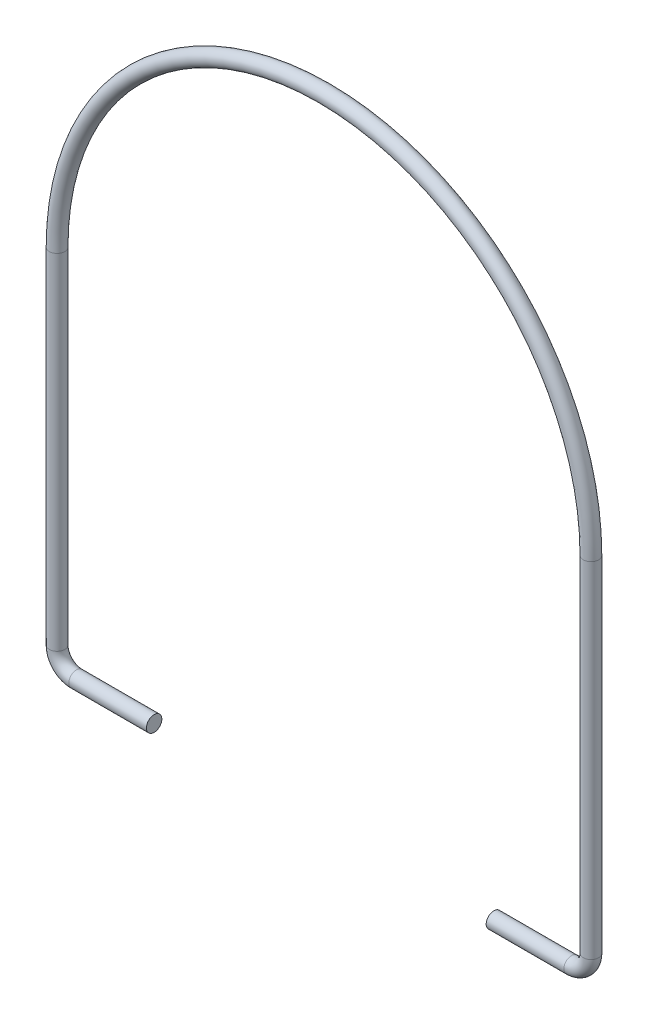
ISO-10303-21;
HEADER;
FILE_DESCRIPTION(('STEP AP214'),'2;1');
FILE_NAME('part.step','',(''),(''),'','','');
FILE_SCHEMA(('AUTOMOTIVE_DESIGN { 1 0 10303 214 1 1 1 1 }'));
ENDSEC;
DATA;
#1=APPLICATION_CONTEXT('core data for automotive mechanical design processes');
#2=APPLICATION_PROTOCOL_DEFINITION('international standard','automotive_design',2000,#1);
#3=PRODUCT_CONTEXT('',#1,'mechanical');
#4=PRODUCT('Part','Part','',(#3));
#5=PRODUCT_RELATED_PRODUCT_CATEGORY('part','',(#4));
#6=PRODUCT_DEFINITION_FORMATION('','',#4);
#7=PRODUCT_DEFINITION_CONTEXT('part definition',#1,'design');
#8=PRODUCT_DEFINITION('design','',#6,#7);
#9=PRODUCT_DEFINITION_SHAPE('','',#8);
#10=(LENGTH_UNIT() NAMED_UNIT(*) SI_UNIT(.MILLI.,.METRE.));
#11=(NAMED_UNIT(*) PLANE_ANGLE_UNIT() SI_UNIT($,.RADIAN.));
#12=(NAMED_UNIT(*) SI_UNIT($,.STERADIAN.) SOLID_ANGLE_UNIT());
#13=UNCERTAINTY_MEASURE_WITH_UNIT(LENGTH_MEASURE(1.E-05),#10,'distance_accuracy_value','');
#14=(GEOMETRIC_REPRESENTATION_CONTEXT(3) GLOBAL_UNCERTAINTY_ASSIGNED_CONTEXT((#13)) GLOBAL_UNIT_ASSIGNED_CONTEXT((#10,
#11,#12)) REPRESENTATION_CONTEXT('',''));
#15=CARTESIAN_POINT('',(0.,0.,0.));
#16=DIRECTION('',(0.,0.,1.));
#17=DIRECTION('',(1.,0.,0.));
#18=AXIS2_PLACEMENT_3D('',#15,#16,#17);
#19=CARTESIAN_POINT('',(86.,0.,0.));
#20=DIRECTION('',(-1.,0.,0.));
#21=DIRECTION('',(0.,-1.,0.));
#22=AXIS2_PLACEMENT_3D('',#19,#20,#21);
#23=CYLINDRICAL_SURFACE('',#22,1.5875);
#24=CARTESIAN_POINT('',(86.,0.,0.));
#25=DIRECTION('',(1.,0.,0.));
#26=DIRECTION('',(0.,0.,-1.));
#27=AXIS2_PLACEMENT_3D('',#24,#25,#26);
#28=CIRCLE('',#27,1.5875);
#29=CARTESIAN_POINT('',(86.,-1.5875,0.));
#30=VERTEX_POINT('',#29);
#31=EDGE_CURVE('E37',#30,#30,#28,.T.);
#32=ORIENTED_EDGE('',*,*,#31,.F.);
#33=EDGE_LOOP('',(#32));
#34=FACE_BOUND('',#33,.T.);
#35=CARTESIAN_POINT('',(70.,0.,0.));
#36=DIRECTION('',(1.,0.,0.));
#37=DIRECTION('',(0.,0.,-1.));
#38=AXIS2_PLACEMENT_3D('',#35,#36,#37);
#39=CIRCLE('',#38,1.5875);
#40=CARTESIAN_POINT('',(70.,0.,-1.5875));
#41=VERTEX_POINT('',#40);
#42=EDGE_CURVE('E10',#41,#41,#39,.T.);
#43=ORIENTED_EDGE('',*,*,#42,.T.);
#44=EDGE_LOOP('',(#43));
#45=FACE_BOUND('',#44,.T.);
#46=ADVANCED_FACE('F31',(#34,#45),#23,.T.);
#47=CARTESIAN_POINT('',(86.,4.,0.));
#48=DIRECTION('',(0.,0.,-1.));
#49=DIRECTION('',(-1.,0.,0.));
#50=AXIS2_PLACEMENT_3D('',#47,#48,#49);
#51=TOROIDAL_SURFACE('',#50,4.,1.5875);
#52=CARTESIAN_POINT('',(90.,4.,0.));
#53=DIRECTION('',(0.,1.,0.));
#54=DIRECTION('',(0.,0.,-1.));
#55=AXIS2_PLACEMENT_3D('',#52,#53,#54);
#56=CIRCLE('',#55,1.5875);
#57=CARTESIAN_POINT('',(91.5875,4.,0.));
#58=VERTEX_POINT('',#57);
#59=EDGE_CURVE('E41',#58,#58,#56,.T.);
#60=CARTESIAN_POINT('',(86.,4.,0.));
#61=DIRECTION('',(0.,0.,-1.));
#62=DIRECTION('',(-1.,0.,0.));
#63=AXIS2_PLACEMENT_3D('',#60,#61,#62);
#64=CIRCLE('',#63,5.5875);
#65=EDGE_CURVE('',#58,#30,#64,.T.);
#66=ORIENTED_EDGE('',*,*,#59,.F.);
#67=ORIENTED_EDGE('',*,*,#31,.T.);
#68=ORIENTED_EDGE('',*,*,#65,.T.);
#69=ORIENTED_EDGE('',*,*,#65,.F.);
#70=EDGE_LOOP('',(#66,#68,#67,#69));
#71=FACE_BOUND('',#70,.T.);
#72=ADVANCED_FACE('F87',(#71),#51,.T.);
#73=CARTESIAN_POINT('',(90.,75.,0.));
#74=DIRECTION('',(0.,-1.,0.));
#75=DIRECTION('',(0.,0.,-1.));
#76=AXIS2_PLACEMENT_3D('',#73,#74,#75);
#77=CYLINDRICAL_SURFACE('',#76,1.5875);
#78=CARTESIAN_POINT('',(90.,75.,0.));
#79=DIRECTION('',(0.,1.,0.));
#80=DIRECTION('',(0.,0.,-1.));
#81=AXIS2_PLACEMENT_3D('',#78,#79,#80);
#82=CIRCLE('',#81,1.5875);
#83=CARTESIAN_POINT('',(91.5875,75.,0.));
#84=VERTEX_POINT('',#83);
#85=EDGE_CURVE('E45',#84,#84,#82,.T.);
#86=ORIENTED_EDGE('',*,*,#85,.F.);
#87=EDGE_LOOP('',(#86));
#88=FACE_BOUND('',#87,.T.);
#89=ORIENTED_EDGE('',*,*,#59,.T.);
#90=EDGE_LOOP('',(#89));
#91=FACE_BOUND('',#90,.T.);
#92=ADVANCED_FACE('F81',(#88,#91),#77,.T.);
#93=CARTESIAN_POINT('',(35.,75.,0.));
#94=DIRECTION('',(0.,0.,-1.));
#95=DIRECTION('',(-1.,0.,0.));
#96=AXIS2_PLACEMENT_3D('',#93,#94,#95);
#97=TOROIDAL_SURFACE('',#96,55.,1.5875);
#98=CARTESIAN_POINT('',(-20.,75.,0.));
#99=DIRECTION('',(0.,-1.,0.));
#100=DIRECTION('',(0.,0.,-1.));
#101=AXIS2_PLACEMENT_3D('',#98,#99,#100);
#102=CIRCLE('',#101,1.5875);
#103=CARTESIAN_POINT('',(-21.5875,75.,0.));
#104=VERTEX_POINT('',#103);
#105=EDGE_CURVE('E50',#104,#104,#102,.T.);
#106=CARTESIAN_POINT('',(35.,75.,0.));
#107=DIRECTION('',(0.,0.,-1.));
#108=DIRECTION('',(-1.,0.,0.));
#109=AXIS2_PLACEMENT_3D('',#106,#107,#108);
#110=CIRCLE('',#109,56.5875);
#111=EDGE_CURVE('',#104,#84,#110,.T.);
#112=ORIENTED_EDGE('',*,*,#105,.F.);
#113=ORIENTED_EDGE('',*,*,#85,.T.);
#114=ORIENTED_EDGE('',*,*,#111,.T.);
#115=ORIENTED_EDGE('',*,*,#111,.F.);
#116=EDGE_LOOP('',(#112,#114,#113,#115));
#117=FACE_BOUND('',#116,.T.);
#118=ADVANCED_FACE('F75',(#117),#97,.T.);
#119=CARTESIAN_POINT('',(-20.,4.,0.));
#120=DIRECTION('',(0.,1.,0.));
#121=DIRECTION('',(-1.,0.,0.));
#122=AXIS2_PLACEMENT_3D('',#119,#120,#121);
#123=CYLINDRICAL_SURFACE('',#122,1.5875);
#124=CARTESIAN_POINT('',(-20.,4.,0.));
#125=DIRECTION('',(0.,-1.,0.));
#126=DIRECTION('',(0.,0.,-1.));
#127=AXIS2_PLACEMENT_3D('',#124,#125,#126);
#128=CIRCLE('',#127,1.5875);
#129=CARTESIAN_POINT('',(-21.5875,4.,0.));
#130=VERTEX_POINT('',#129);
#131=EDGE_CURVE('E53',#130,#130,#128,.T.);
#132=ORIENTED_EDGE('',*,*,#131,.F.);
#133=EDGE_LOOP('',(#132));
#134=FACE_BOUND('',#133,.T.);
#135=ORIENTED_EDGE('',*,*,#105,.T.);
#136=EDGE_LOOP('',(#135));
#137=FACE_BOUND('',#136,.T.);
#138=ADVANCED_FACE('F69',(#134,#137),#123,.T.);
#139=CARTESIAN_POINT('',(-16.,4.,0.));
#140=DIRECTION('',(0.,0.,-1.));
#141=DIRECTION('',(-1.,0.,0.));
#142=AXIS2_PLACEMENT_3D('',#139,#140,#141);
#143=TOROIDAL_SURFACE('',#142,4.,1.5875);
#144=CARTESIAN_POINT('',(-16.,0.,0.));
#145=DIRECTION('',(1.,0.,0.));
#146=DIRECTION('',(0.,0.,-1.));
#147=AXIS2_PLACEMENT_3D('',#144,#145,#146);
#148=CIRCLE('',#147,1.5875);
#149=CARTESIAN_POINT('',(-16.,-1.5875,0.));
#150=VERTEX_POINT('',#149);
#151=EDGE_CURVE('E56',#150,#150,#148,.T.);
#152=CARTESIAN_POINT('',(-16.,4.,0.));
#153=DIRECTION('',(0.,0.,-1.));
#154=DIRECTION('',(-1.,0.,0.));
#155=AXIS2_PLACEMENT_3D('',#152,#153,#154);
#156=CIRCLE('',#155,5.5875);
#157=EDGE_CURVE('',#150,#130,#156,.T.);
#158=ORIENTED_EDGE('',*,*,#151,.F.);
#159=ORIENTED_EDGE('',*,*,#131,.T.);
#160=ORIENTED_EDGE('',*,*,#157,.T.);
#161=ORIENTED_EDGE('',*,*,#157,.F.);
#162=EDGE_LOOP('',(#158,#160,#159,#161));
#163=FACE_BOUND('',#162,.T.);
#164=ADVANCED_FACE('F66',(#163),#143,.T.);
#165=CARTESIAN_POINT('',(-16.,0.,0.));
#166=DIRECTION('',(1.,0.,0.));
#167=DIRECTION('',(0.,1.,0.));
#168=AXIS2_PLACEMENT_3D('',#165,#166,#167);
#169=CYLINDRICAL_SURFACE('',#168,1.5875);
#170=ORIENTED_EDGE('',*,*,#151,.T.);
#171=EDGE_LOOP('',(#170));
#172=FACE_BOUND('',#171,.T.);
#173=CARTESIAN_POINT('',(0.,0.,0.));
#174=DIRECTION('',(1.,0.,0.));
#175=DIRECTION('',(0.,0.,-1.));
#176=AXIS2_PLACEMENT_3D('',#173,#174,#175);
#177=CIRCLE('',#176,1.5875);
#178=CARTESIAN_POINT('',(0.,0.,-1.5875));
#179=VERTEX_POINT('',#178);
#180=EDGE_CURVE('E57',#179,#179,#177,.T.);
#181=ORIENTED_EDGE('',*,*,#180,.F.);
#182=EDGE_LOOP('',(#181));
#183=FACE_BOUND('',#182,.T.);
#184=ADVANCED_FACE('F63',(#172,#183),#169,.T.);
#185=CARTESIAN_POINT('',(70.,0.,0.));
#186=DIRECTION('',(1.,0.,0.));
#187=DIRECTION('',(0.,0.,-1.));
#188=AXIS2_PLACEMENT_3D('',#185,#186,#187);
#189=PLANE('',#188);
#190=ORIENTED_EDGE('',*,*,#42,.F.);
#191=EDGE_LOOP('',(#190));
#192=FACE_BOUND('',#191,.T.);
#193=ADVANCED_FACE('F99',(#192),#189,.F.);
#194=CARTESIAN_POINT('',(0.,0.,0.));
#195=DIRECTION('',(1.,0.,0.));
#196=DIRECTION('',(0.,0.,-1.));
#197=AXIS2_PLACEMENT_3D('',#194,#195,#196);
#198=PLANE('',#197);
#199=ORIENTED_EDGE('',*,*,#180,.T.);
#200=EDGE_LOOP('',(#199));
#201=FACE_BOUND('',#200,.T.);
#202=ADVANCED_FACE('F100',(#201),#198,.T.);
#203=CLOSED_SHELL('',(#46,#72,#92,#118,#138,#164,#184,#193,#202));
#204=MANIFOLD_SOLID_BREP('B2',#203);
#205=ADVANCED_BREP_SHAPE_REPRESENTATION('',(#18,#204),#14);
#206=SHAPE_DEFINITION_REPRESENTATION(#9,#205);
ENDSEC;
END-ISO-10303-21;
